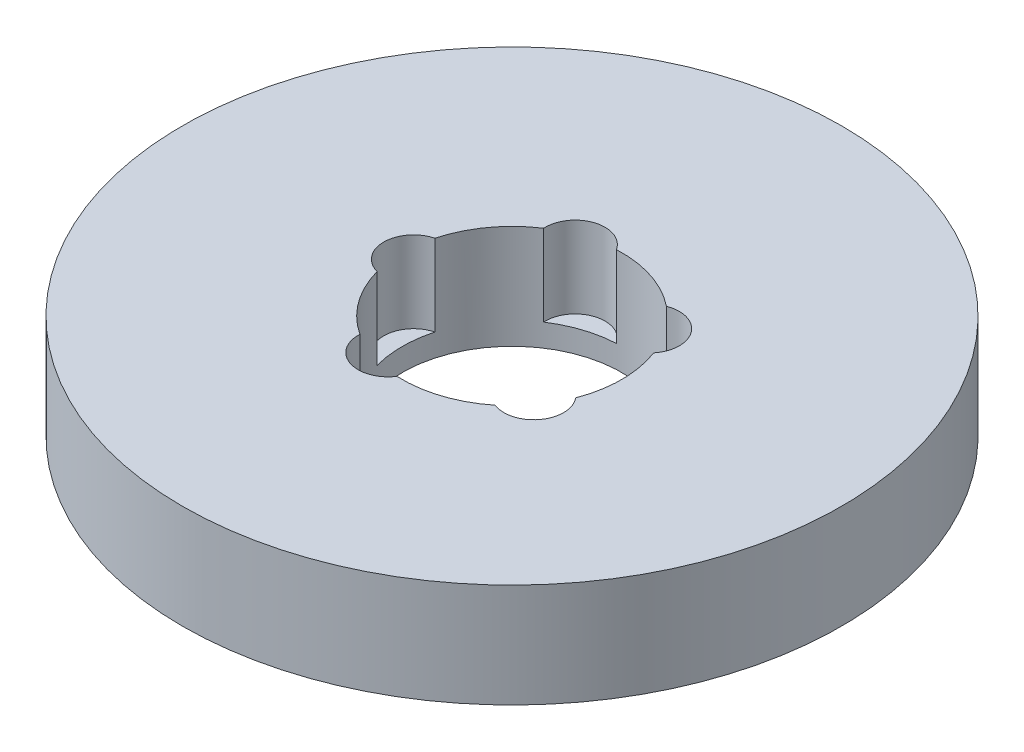
ISO-10303-21;
HEADER;
FILE_DESCRIPTION(('STEP AP214'),'2;1');
FILE_NAME('part.step','',(''),(''),'','','');
FILE_SCHEMA(('AUTOMOTIVE_DESIGN { 1 0 10303 214 1 1 1 1 }'));
ENDSEC;
DATA;
#1=APPLICATION_CONTEXT('core data for automotive mechanical design processes');
#2=APPLICATION_PROTOCOL_DEFINITION('international standard','automotive_design',2000,#1);
#3=PRODUCT_CONTEXT('',#1,'mechanical');
#4=PRODUCT('Part','Part','',(#3));
#5=PRODUCT_RELATED_PRODUCT_CATEGORY('part','',(#4));
#6=PRODUCT_DEFINITION_FORMATION('','',#4);
#7=PRODUCT_DEFINITION_CONTEXT('part definition',#1,'design');
#8=PRODUCT_DEFINITION('design','',#6,#7);
#9=PRODUCT_DEFINITION_SHAPE('','',#8);
#10=(LENGTH_UNIT() NAMED_UNIT(*) SI_UNIT(.MILLI.,.METRE.));
#11=(NAMED_UNIT(*) PLANE_ANGLE_UNIT() SI_UNIT($,.RADIAN.));
#12=(NAMED_UNIT(*) SI_UNIT($,.STERADIAN.) SOLID_ANGLE_UNIT());
#13=UNCERTAINTY_MEASURE_WITH_UNIT(LENGTH_MEASURE(1.E-05),#10,'distance_accuracy_value','');
#14=(GEOMETRIC_REPRESENTATION_CONTEXT(3) GLOBAL_UNCERTAINTY_ASSIGNED_CONTEXT((#13)) GLOBAL_UNIT_ASSIGNED_CONTEXT((#10,
#11,#12)) REPRESENTATION_CONTEXT('',''));
#15=CARTESIAN_POINT('',(0.,0.,0.));
#16=DIRECTION('',(0.,0.,1.));
#17=DIRECTION('',(1.,0.,0.));
#18=AXIS2_PLACEMENT_3D('',#15,#16,#17);
#19=CARTESIAN_POINT('',(0.,26.,0.));
#20=DIRECTION('',(0.,-1.,0.));
#21=DIRECTION('',(0.,0.,-1.));
#22=AXIS2_PLACEMENT_3D('',#19,#20,#21);
#23=CYLINDRICAL_SURFACE('',#22,82.5);
#24=CARTESIAN_POINT('',(0.,26.,0.));
#25=DIRECTION('',(0.,1.,0.));
#26=DIRECTION('',(0.,0.,1.));
#27=AXIS2_PLACEMENT_3D('',#24,#25,#26);
#28=CIRCLE('',#27,82.5);
#29=CARTESIAN_POINT('',(0.,26.,-82.5));
#30=VERTEX_POINT('',#29);
#31=EDGE_CURVE('E151',#30,#30,#28,.T.);
#32=CARTESIAN_POINT('',(0.,0.,0.));
#33=DIRECTION('',(0.,1.,0.));
#34=DIRECTION('',(0.,0.,1.));
#35=AXIS2_PLACEMENT_3D('',#32,#33,#34);
#36=CIRCLE('',#35,82.5);
#37=CARTESIAN_POINT('',(0.,0.,-82.5));
#38=VERTEX_POINT('',#37);
#39=EDGE_CURVE('E150',#38,#38,#36,.T.);
#40=CARTESIAN_POINT('',(0.,26.,-82.5));
#41=CARTESIAN_POINT('',(0.,25.7291666666667,-82.5));
#42=CARTESIAN_POINT('',(0.,25.4583333333333,-82.5));
#43=CARTESIAN_POINT('',(0.,24.9166666666667,-82.5));
#44=CARTESIAN_POINT('',(0.,24.6458333333333,-82.5));
#45=CARTESIAN_POINT('',(0.,24.1041666666667,-82.5));
#46=CARTESIAN_POINT('',(0.,23.8333333333333,-82.5));
#47=CARTESIAN_POINT('',(0.,23.2916666666667,-82.5));
#48=CARTESIAN_POINT('',(0.,23.0208333333333,-82.5));
#49=CARTESIAN_POINT('',(0.,22.4791666666667,-82.5));
#50=CARTESIAN_POINT('',(0.,22.2083333333333,-82.5));
#51=CARTESIAN_POINT('',(0.,21.6666666666667,-82.5));
#52=CARTESIAN_POINT('',(0.,21.3958333333333,-82.5));
#53=CARTESIAN_POINT('',(0.,20.8541666666667,-82.5));
#54=CARTESIAN_POINT('',(0.,20.5833333333333,-82.5));
#55=CARTESIAN_POINT('',(0.,20.0416666666667,-82.5));
#56=CARTESIAN_POINT('',(0.,19.7708333333333,-82.5));
#57=CARTESIAN_POINT('',(0.,19.2291666666667,-82.5));
#58=CARTESIAN_POINT('',(0.,18.9583333333333,-82.5));
#59=CARTESIAN_POINT('',(0.,18.4166666666667,-82.5));
#60=CARTESIAN_POINT('',(0.,18.1458333333333,-82.5));
#61=CARTESIAN_POINT('',(0.,17.6041666666667,-82.5));
#62=CARTESIAN_POINT('',(0.,17.3333333333333,-82.5));
#63=CARTESIAN_POINT('',(0.,16.7916666666667,-82.5));
#64=CARTESIAN_POINT('',(0.,16.5208333333333,-82.5));
#65=CARTESIAN_POINT('',(0.,15.9791666666667,-82.5));
#66=CARTESIAN_POINT('',(0.,15.7083333333333,-82.5));
#67=CARTESIAN_POINT('',(0.,15.1666666666667,-82.5));
#68=CARTESIAN_POINT('',(0.,14.8958333333333,-82.5));
#69=CARTESIAN_POINT('',(0.,14.3541666666667,-82.5));
#70=CARTESIAN_POINT('',(0.,14.0833333333333,-82.5));
#71=CARTESIAN_POINT('',(0.,13.5416666666667,-82.5));
#72=CARTESIAN_POINT('',(0.,13.2708333333333,-82.5));
#73=CARTESIAN_POINT('',(0.,12.7291666666667,-82.5));
#74=CARTESIAN_POINT('',(0.,12.4583333333333,-82.5));
#75=CARTESIAN_POINT('',(0.,11.9166666666667,-82.5));
#76=CARTESIAN_POINT('',(0.,11.6458333333333,-82.5));
#77=CARTESIAN_POINT('',(0.,11.1041666666667,-82.5));
#78=CARTESIAN_POINT('',(0.,10.8333333333333,-82.5));
#79=CARTESIAN_POINT('',(0.,10.2916666666667,-82.5));
#80=CARTESIAN_POINT('',(0.,10.0208333333333,-82.5));
#81=CARTESIAN_POINT('',(0.,9.47916666666667,-82.5));
#82=CARTESIAN_POINT('',(0.,9.20833333333333,-82.5));
#83=CARTESIAN_POINT('',(0.,8.66666666666667,-82.5));
#84=CARTESIAN_POINT('',(0.,8.39583333333333,-82.5));
#85=CARTESIAN_POINT('',(0.,7.85416666666667,-82.5));
#86=CARTESIAN_POINT('',(0.,7.58333333333333,-82.5));
#87=CARTESIAN_POINT('',(0.,7.04166666666667,-82.5));
#88=CARTESIAN_POINT('',(0.,6.77083333333333,-82.5));
#89=CARTESIAN_POINT('',(0.,6.22916666666667,-82.5));
#90=CARTESIAN_POINT('',(0.,5.95833333333333,-82.5));
#91=CARTESIAN_POINT('',(0.,5.41666666666667,-82.5));
#92=CARTESIAN_POINT('',(0.,5.14583333333333,-82.5));
#93=CARTESIAN_POINT('',(0.,4.60416666666667,-82.5));
#94=CARTESIAN_POINT('',(0.,4.33333333333333,-82.5));
#95=CARTESIAN_POINT('',(0.,3.79166666666667,-82.5));
#96=CARTESIAN_POINT('',(0.,3.52083333333333,-82.5));
#97=CARTESIAN_POINT('',(0.,2.97916666666667,-82.5));
#98=CARTESIAN_POINT('',(0.,2.70833333333333,-82.5));
#99=CARTESIAN_POINT('',(0.,2.16666666666667,-82.5));
#100=CARTESIAN_POINT('',(0.,1.89583333333333,-82.5));
#101=CARTESIAN_POINT('',(0.,1.35416666666667,-82.5));
#102=CARTESIAN_POINT('',(0.,1.08333333333333,-82.5));
#103=CARTESIAN_POINT('',(0.,0.541666666666667,-82.5));
#104=CARTESIAN_POINT('',(0.,0.270833333333334,-82.5));
#105=CARTESIAN_POINT('',(0.,0.,-82.5));
#106=B_SPLINE_CURVE_WITH_KNOTS('',3,(#40,#41,#42,#43,#44,#45,#46,#47,#48,#49,#50,#51,#52,#53,
#54,#55,#56,#57,#58,#59,#60,#61,#62,#63,#64,#65,#66,#67,#68,#69,#70,#71,#72,#73,#74,#75,#76,#77,
#78,#79,#80,#81,#82,#83,#84,#85,#86,#87,#88,#89,#90,#91,#92,#93,#94,#95,#96,#97,#98,#99,#100,
#101,#102,#103,#104,#105),.UNSPECIFIED.,.F.,.F.,(4,2,2,2,2,2,2,2,2,2,2,2,2,2,2,2,2,2,2,2,2,2,2,
2,2,2,2,2,2,2,2,2,4),(0.,0.812500000000001,1.625,2.4375,3.25,4.0625,4.875,5.6875,6.5,7.3125,
8.125,8.9375,9.75,10.5625,11.375,12.1875,13.,13.8125,14.625,15.4375,16.25,17.0625,17.875,
18.6875,19.5,20.3125,21.125,21.9375,22.75,23.5625,24.375,25.1875,26.),.UNSPECIFIED.);
#107=EDGE_CURVE('BSEAM39',#30,#38,#106,.T.);
#108=ORIENTED_EDGE('',*,*,#31,.F.);
#109=ORIENTED_EDGE('',*,*,#39,.T.);
#110=ORIENTED_EDGE('',*,*,#107,.T.);
#111=ORIENTED_EDGE('',*,*,#107,.F.);
#112=EDGE_LOOP('',(#108,#110,#109,#111));
#113=FACE_BOUND('',#112,.T.);
#114=ADVANCED_FACE('F39',(#113),#23,.T.);
#115=CARTESIAN_POINT('',(0.,26.,0.));
#116=DIRECTION('',(0.,1.,0.));
#117=DIRECTION('',(0.,0.,1.));
#118=AXIS2_PLACEMENT_3D('',#115,#116,#117);
#119=PLANE('',#118);
#120=CARTESIAN_POINT('',(-7.612484488797,26.,-23.4288181881716));
#121=DIRECTION('',(0.,1.,0.));
#122=DIRECTION('',(-0.95105651629515,0.,0.309016994374958));
#123=AXIS2_PLACEMENT_3D('',#120,#121,#122);
#124=CIRCLE('',#123,7.47453721191515);
#125=CARTESIAN_POINT('',(-1.32339867234192,26.,-27.4681381959907));
#126=VERTEX_POINT('',#125);
#127=CARTESIAN_POINT('',(-15.0747145232776,26.,-23.0000648269018));
#128=VERTEX_POINT('',#127);
#129=EDGE_CURVE('E196',#126,#128,#124,.T.);
#130=ORIENTED_EDGE('',*,*,#129,.F.);
#131=CARTESIAN_POINT('',(0.,26.,0.));
#132=DIRECTION('',(0.,1.,0.));
#133=DIRECTION('',(0.,0.,1.));
#134=AXIS2_PLACEMENT_3D('',#131,#132,#133);
#135=CIRCLE('',#134,27.5);
#136=CARTESIAN_POINT('',(17.2160185557923,26.,-21.4443163818904));
#137=VERTEX_POINT('',#136);
#138=EDGE_CURVE('E156',#137,#126,#135,.T.);
#139=ORIENTED_EDGE('',*,*,#138,.F.);
#140=CARTESIAN_POINT('',(19.9297431305011,26.,-14.479805956532));
#141=DIRECTION('',(0.,1.,0.));
#142=DIRECTION('',(-0.58778525229248,0.,-0.809016994374942));
#143=AXIS2_PLACEMENT_3D('',#140,#141,#142);
#144=CIRCLE('',#143,7.47453721191515);
#145=CARTESIAN_POINT('',(25.7147991417059,26.,-9.74674843738781));
#146=VERTEX_POINT('',#145);
#147=EDGE_CURVE('E254',#146,#137,#144,.T.);
#148=ORIENTED_EDGE('',*,*,#147,.F.);
#149=CARTESIAN_POINT('',(25.714799141706,26.,9.74674843738744));
#150=VERTEX_POINT('',#149);
#151=EDGE_CURVE('E153',#150,#146,#135,.T.);
#152=ORIENTED_EDGE('',*,*,#151,.F.);
#153=CARTESIAN_POINT('',(19.9297431305013,26.,14.4798059565317));
#154=DIRECTION('',(0.,1.,0.));
#155=DIRECTION('',(0.587785252292469,0.,-0.809016994374951));
#156=AXIS2_PLACEMENT_3D('',#153,#154,#155);
#157=CIRCLE('',#156,7.47453721191515);
#158=CARTESIAN_POINT('',(17.2160185557926,26.,21.4443163818902));
#159=VERTEX_POINT('',#158);
#160=EDGE_CURVE('E248',#159,#150,#157,.T.);
#161=ORIENTED_EDGE('',*,*,#160,.F.);
#162=CARTESIAN_POINT('',(-1.32339867234153,26.,27.4681381959907));
#163=VERTEX_POINT('',#162);
#164=EDGE_CURVE('E140',#163,#159,#135,.T.);
#165=ORIENTED_EDGE('',*,*,#164,.F.);
#166=CARTESIAN_POINT('',(-7.61248448879667,26.,23.4288181881717));
#167=DIRECTION('',(0.,1.,0.));
#168=DIRECTION('',(0.951056516295155,0.,0.309016994374945));
#169=AXIS2_PLACEMENT_3D('',#166,#167,#168);
#170=CIRCLE('',#169,7.47453721191515);
#171=CARTESIAN_POINT('',(-15.0747145232773,26.,23.000064826902));
#172=VERTEX_POINT('',#171);
#173=EDGE_CURVE('E117',#172,#163,#170,.T.);
#174=ORIENTED_EDGE('',*,*,#173,.F.);
#175=CARTESIAN_POINT('',(-26.5327045018796,26.,7.22949457541391));
#176=VERTEX_POINT('',#175);
#177=EDGE_CURVE('E133',#176,#172,#135,.T.);
#178=ORIENTED_EDGE('',*,*,#177,.F.);
#179=CARTESIAN_POINT('',(-24.634517283409,26.,0.));
#180=DIRECTION('',(0.,1.,0.));
#181=DIRECTION('',(0.,0.,1.));
#182=AXIS2_PLACEMENT_3D('',#179,#180,#181);
#183=CIRCLE('',#182,7.47453721191515);
#184=CARTESIAN_POINT('',(-26.5327045018796,26.,-7.22949457541391));
#185=VERTEX_POINT('',#184);
#186=EDGE_CURVE('E170',#185,#176,#183,.T.);
#187=ORIENTED_EDGE('',*,*,#186,.F.);
#188=EDGE_CURVE('E149',#128,#185,#135,.T.);
#189=ORIENTED_EDGE('',*,*,#188,.F.);
#190=EDGE_LOOP('',(#130,#139,#148,#152,#161,#165,#174,#178,#187,#189));
#191=FACE_BOUND('',#190,.T.);
#192=ORIENTED_EDGE('',*,*,#31,.T.);
#193=EDGE_LOOP('',(#192));
#194=FACE_BOUND('',#193,.T.);
#195=ADVANCED_FACE('F131',(#191,#194),#119,.T.);
#196=CARTESIAN_POINT('',(0.,0.,0.));
#197=DIRECTION('',(0.,1.,0.));
#198=DIRECTION('',(0.,0.,1.));
#199=AXIS2_PLACEMENT_3D('',#196,#197,#198);
#200=PLANE('',#199);
#201=CARTESIAN_POINT('',(0.,0.,0.));
#202=DIRECTION('',(0.,1.,0.));
#203=DIRECTION('',(0.,0.,1.));
#204=AXIS2_PLACEMENT_3D('',#201,#202,#203);
#205=CIRCLE('',#204,27.5);
#206=CARTESIAN_POINT('',(0.,0.,27.5));
#207=VERTEX_POINT('',#206);
#208=EDGE_CURVE('E160',#207,#207,#205,.T.);
#209=ORIENTED_EDGE('',*,*,#208,.T.);
#210=EDGE_LOOP('',(#209));
#211=FACE_BOUND('',#210,.T.);
#212=ORIENTED_EDGE('',*,*,#39,.F.);
#213=EDGE_LOOP('',(#212));
#214=FACE_BOUND('',#213,.T.);
#215=ADVANCED_FACE('F212',(#211,#214),#200,.F.);
#216=CARTESIAN_POINT('',(0.,26.,0.));
#217=DIRECTION('',(0.,-1.,0.));
#218=DIRECTION('',(0.,0.,-1.));
#219=AXIS2_PLACEMENT_3D('',#216,#217,#218);
#220=CYLINDRICAL_SURFACE('',#219,27.5);
#221=DIRECTION('',(0.,1.,0.));
#222=VECTOR('',#221,1.);
#223=CARTESIAN_POINT('',(-1.32339867234192,15.826622380228,-27.4681381959907));
#224=LINE('',#223,#222);
#225=CARTESIAN_POINT('',(-1.32339867234192,5.6532447604561,-27.4681381959907));
#226=VERTEX_POINT('',#225);
#227=EDGE_CURVE('E11',#226,#126,#224,.T.);
#228=ORIENTED_EDGE('',*,*,#227,.F.);
#229=CARTESIAN_POINT('',(0.,5.6532447604561,0.));
#230=DIRECTION('',(0.,1.,0.));
#231=DIRECTION('',(0.,0.,1.));
#232=AXIS2_PLACEMENT_3D('',#229,#230,#231);
#233=CIRCLE('',#232,27.5);
#234=CARTESIAN_POINT('',(-15.0747145232776,5.6532447604561,-23.0000648269018));
#235=VERTEX_POINT('',#234);
#236=EDGE_CURVE('E193',#226,#235,#233,.T.);
#237=ORIENTED_EDGE('',*,*,#236,.T.);
#238=DIRECTION('',(0.,1.,0.));
#239=VECTOR('',#238,1.);
#240=CARTESIAN_POINT('',(-15.0747145232776,15.826622380228,-23.0000648269018));
#241=LINE('',#240,#239);
#242=EDGE_CURVE('E46',#128,#235,#241,.F.);
#243=ORIENTED_EDGE('',*,*,#242,.F.);
#244=ORIENTED_EDGE('',*,*,#188,.T.);
#245=DIRECTION('',(0.,1.,0.));
#246=VECTOR('',#245,1.);
#247=CARTESIAN_POINT('',(-26.5327045018796,15.826622380228,-7.22949457541391));
#248=LINE('',#247,#246);
#249=CARTESIAN_POINT('',(-26.5327045018796,5.6532447604561,-7.22949457541391));
#250=VERTEX_POINT('',#249);
#251=EDGE_CURVE('E174',#250,#185,#248,.T.);
#252=ORIENTED_EDGE('',*,*,#251,.F.);
#253=CARTESIAN_POINT('',(0.,5.6532447604561,0.));
#254=DIRECTION('',(0.,1.,0.));
#255=DIRECTION('',(0.,0.,1.));
#256=AXIS2_PLACEMENT_3D('',#253,#254,#255);
#257=CIRCLE('',#256,27.5);
#258=CARTESIAN_POINT('',(-26.5327045018796,5.6532447604561,7.22949457541391));
#259=VERTEX_POINT('',#258);
#260=EDGE_CURVE('E171',#250,#259,#257,.T.);
#261=ORIENTED_EDGE('',*,*,#260,.T.);
#262=DIRECTION('',(0.,1.,0.));
#263=VECTOR('',#262,1.);
#264=CARTESIAN_POINT('',(-26.5327045018796,15.826622380228,7.22949457541391));
#265=LINE('',#264,#263);
#266=EDGE_CURVE('E148',#176,#259,#265,.F.);
#267=ORIENTED_EDGE('',*,*,#266,.F.);
#268=ORIENTED_EDGE('',*,*,#177,.T.);
#269=DIRECTION('',(0.,1.,0.));
#270=VECTOR('',#269,1.);
#271=CARTESIAN_POINT('',(-15.0747145232773,15.826622380228,23.000064826902));
#272=LINE('',#271,#270);
#273=CARTESIAN_POINT('',(-15.0747145232773,5.6532447604561,23.000064826902));
#274=VERTEX_POINT('',#273);
#275=EDGE_CURVE('E111',#274,#172,#272,.T.);
#276=ORIENTED_EDGE('',*,*,#275,.F.);
#277=CARTESIAN_POINT('',(0.,5.6532447604561,0.));
#278=DIRECTION('',(0.,1.,0.));
#279=DIRECTION('',(0.,0.,1.));
#280=AXIS2_PLACEMENT_3D('',#277,#278,#279);
#281=CIRCLE('',#280,27.5);
#282=CARTESIAN_POINT('',(-1.32339867234153,5.6532447604561,27.4681381959907));
#283=VERTEX_POINT('',#282);
#284=EDGE_CURVE('E180',#274,#283,#281,.T.);
#285=ORIENTED_EDGE('',*,*,#284,.T.);
#286=DIRECTION('',(0.,1.,0.));
#287=VECTOR('',#286,1.);
#288=CARTESIAN_POINT('',(-1.32339867234153,15.826622380228,27.4681381959907));
#289=LINE('',#288,#287);
#290=EDGE_CURVE('E124',#163,#283,#289,.F.);
#291=ORIENTED_EDGE('',*,*,#290,.F.);
#292=ORIENTED_EDGE('',*,*,#164,.T.);
#293=DIRECTION('',(0.,1.,0.));
#294=VECTOR('',#293,1.);
#295=CARTESIAN_POINT('',(17.2160185557927,15.826622380228,21.4443163818902));
#296=LINE('',#295,#294);
#297=CARTESIAN_POINT('',(17.2160185557926,5.6532447604561,21.4443163818902));
#298=VERTEX_POINT('',#297);
#299=EDGE_CURVE('E183',#298,#159,#296,.T.);
#300=ORIENTED_EDGE('',*,*,#299,.F.);
#301=CARTESIAN_POINT('',(0.,5.6532447604561,0.));
#302=DIRECTION('',(0.,1.,0.));
#303=DIRECTION('',(0.,0.,1.));
#304=AXIS2_PLACEMENT_3D('',#301,#302,#303);
#305=CIRCLE('',#304,27.5);
#306=CARTESIAN_POINT('',(25.714799141706,5.6532447604561,9.74674843738744));
#307=VERTEX_POINT('',#306);
#308=EDGE_CURVE('E123',#298,#307,#305,.T.);
#309=ORIENTED_EDGE('',*,*,#308,.T.);
#310=DIRECTION('',(0.,1.,0.));
#311=VECTOR('',#310,1.);
#312=CARTESIAN_POINT('',(25.714799141706,15.826622380228,9.74674843738744));
#313=LINE('',#312,#311);
#314=EDGE_CURVE('E185',#150,#307,#313,.F.);
#315=ORIENTED_EDGE('',*,*,#314,.F.);
#316=ORIENTED_EDGE('',*,*,#151,.T.);
#317=DIRECTION('',(0.,1.,0.));
#318=VECTOR('',#317,1.);
#319=CARTESIAN_POINT('',(25.7147991417059,15.826622380228,-9.74674843738781));
#320=LINE('',#319,#318);
#321=CARTESIAN_POINT('',(25.7147991417059,5.6532447604561,-9.74674843738781));
#322=VERTEX_POINT('',#321);
#323=EDGE_CURVE('E195',#322,#146,#320,.T.);
#324=ORIENTED_EDGE('',*,*,#323,.F.);
#325=CARTESIAN_POINT('',(0.,5.6532447604561,0.));
#326=DIRECTION('',(0.,1.,0.));
#327=DIRECTION('',(0.,0.,1.));
#328=AXIS2_PLACEMENT_3D('',#325,#326,#327);
#329=CIRCLE('',#328,27.5);
#330=CARTESIAN_POINT('',(17.2160185557923,5.6532447604561,-21.4443163818904));
#331=VERTEX_POINT('',#330);
#332=EDGE_CURVE('E190',#322,#331,#329,.T.);
#333=ORIENTED_EDGE('',*,*,#332,.T.);
#334=DIRECTION('',(0.,1.,0.));
#335=VECTOR('',#334,1.);
#336=CARTESIAN_POINT('',(17.2160185557923,15.826622380228,-21.4443163818904));
#337=LINE('',#336,#335);
#338=EDGE_CURVE('E189',#137,#331,#337,.F.);
#339=ORIENTED_EDGE('',*,*,#338,.F.);
#340=ORIENTED_EDGE('',*,*,#138,.T.);
#341=EDGE_LOOP('',(#228,#237,#243,#244,#252,#261,#267,#268,#276,#285,#291,#292,#300,#309,#315,
#316,#324,#333,#339,#340));
#342=FACE_BOUND('',#341,.T.);
#343=ORIENTED_EDGE('',*,*,#208,.F.);
#344=EDGE_LOOP('',(#343));
#345=FACE_BOUND('',#344,.T.);
#346=ADVANCED_FACE('F142',(#342,#345),#220,.F.);
#347=CARTESIAN_POINT('',(-24.634517283409,5.6532447604561,0.));
#348=DIRECTION('',(0.,1.,0.));
#349=DIRECTION('',(0.,0.,1.));
#350=AXIS2_PLACEMENT_3D('',#347,#348,#349);
#351=CYLINDRICAL_SURFACE('',#350,7.47453721191515);
#352=ORIENTED_EDGE('',*,*,#251,.T.);
#353=ORIENTED_EDGE('',*,*,#186,.T.);
#354=ORIENTED_EDGE('',*,*,#266,.T.);
#355=CARTESIAN_POINT('',(-24.634517283409,5.6532447604561,0.));
#356=DIRECTION('',(0.,1.,0.));
#357=DIRECTION('',(0.,0.,1.));
#358=AXIS2_PLACEMENT_3D('',#355,#356,#357);
#359=CIRCLE('',#358,7.47453721191515);
#360=EDGE_CURVE('E163',#250,#259,#359,.T.);
#361=ORIENTED_EDGE('',*,*,#360,.F.);
#362=EDGE_LOOP('',(#352,#353,#354,#361));
#363=FACE_BOUND('',#362,.T.);
#364=ADVANCED_FACE('F221',(#363),#351,.F.);
#365=CARTESIAN_POINT('',(-24.634517283409,5.6532447604561,0.));
#366=DIRECTION('',(0.,1.,0.));
#367=DIRECTION('',(0.,0.,1.));
#368=AXIS2_PLACEMENT_3D('',#365,#366,#367);
#369=PLANE('',#368);
#370=ORIENTED_EDGE('',*,*,#360,.T.);
#371=ORIENTED_EDGE('',*,*,#260,.F.);
#372=EDGE_LOOP('',(#370,#371));
#373=FACE_BOUND('',#372,.T.);
#374=ADVANCED_FACE('F227',(#373),#369,.T.);
#375=CARTESIAN_POINT('',(-7.61248448879667,5.6532447604561,23.4288181881717));
#376=DIRECTION('',(0.,1.,0.));
#377=DIRECTION('',(0.,0.,1.));
#378=AXIS2_PLACEMENT_3D('',#375,#376,#377);
#379=CYLINDRICAL_SURFACE('',#378,7.47453721191515);
#380=ORIENTED_EDGE('',*,*,#275,.T.);
#381=ORIENTED_EDGE('',*,*,#173,.T.);
#382=ORIENTED_EDGE('',*,*,#290,.T.);
#383=CARTESIAN_POINT('',(-7.61248448879667,5.6532447604561,23.4288181881717));
#384=DIRECTION('',(0.,1.,0.));
#385=DIRECTION('',(0.951056516295155,0.,0.309016994374945));
#386=AXIS2_PLACEMENT_3D('',#383,#384,#385);
#387=CIRCLE('',#386,7.47453721191515);
#388=EDGE_CURVE('E119',#274,#283,#387,.T.);
#389=ORIENTED_EDGE('',*,*,#388,.F.);
#390=EDGE_LOOP('',(#380,#381,#382,#389));
#391=FACE_BOUND('',#390,.T.);
#392=ADVANCED_FACE('F116',(#391),#379,.F.);
#393=CARTESIAN_POINT('',(-7.61248448879667,5.6532447604561,23.4288181881717));
#394=DIRECTION('',(0.,1.,0.));
#395=DIRECTION('',(0.951056516295155,0.,0.309016994374945));
#396=AXIS2_PLACEMENT_3D('',#393,#394,#395);
#397=PLANE('',#396);
#398=ORIENTED_EDGE('',*,*,#388,.T.);
#399=ORIENTED_EDGE('',*,*,#284,.F.);
#400=EDGE_LOOP('',(#398,#399));
#401=FACE_BOUND('',#400,.T.);
#402=ADVANCED_FACE('F234',(#401),#397,.T.);
#403=CARTESIAN_POINT('',(19.9297431305013,5.6532447604561,14.4798059565317));
#404=DIRECTION('',(0.,1.,0.));
#405=DIRECTION('',(0.,0.,1.));
#406=AXIS2_PLACEMENT_3D('',#403,#404,#405);
#407=CYLINDRICAL_SURFACE('',#406,7.47453721191515);
#408=ORIENTED_EDGE('',*,*,#299,.T.);
#409=ORIENTED_EDGE('',*,*,#160,.T.);
#410=ORIENTED_EDGE('',*,*,#314,.T.);
#411=CARTESIAN_POINT('',(19.9297431305013,5.6532447604561,14.4798059565317));
#412=DIRECTION('',(0.,1.,0.));
#413=DIRECTION('',(0.587785252292469,0.,-0.809016994374951));
#414=AXIS2_PLACEMENT_3D('',#411,#412,#413);
#415=CIRCLE('',#414,7.47453721191515);
#416=EDGE_CURVE('E137',#298,#307,#415,.T.);
#417=ORIENTED_EDGE('',*,*,#416,.F.);
#418=EDGE_LOOP('',(#408,#409,#410,#417));
#419=FACE_BOUND('',#418,.T.);
#420=ADVANCED_FACE('F240',(#419),#407,.F.);
#421=CARTESIAN_POINT('',(19.9297431305013,5.6532447604561,14.4798059565317));
#422=DIRECTION('',(0.,1.,0.));
#423=DIRECTION('',(0.587785252292469,0.,-0.809016994374951));
#424=AXIS2_PLACEMENT_3D('',#421,#422,#423);
#425=PLANE('',#424);
#426=ORIENTED_EDGE('',*,*,#416,.T.);
#427=ORIENTED_EDGE('',*,*,#308,.F.);
#428=EDGE_LOOP('',(#426,#427));
#429=FACE_BOUND('',#428,.T.);
#430=ADVANCED_FACE('F245',(#429),#425,.T.);
#431=CARTESIAN_POINT('',(19.9297431305011,5.6532447604561,-14.479805956532));
#432=DIRECTION('',(0.,1.,0.));
#433=DIRECTION('',(0.,0.,1.));
#434=AXIS2_PLACEMENT_3D('',#431,#432,#433);
#435=CYLINDRICAL_SURFACE('',#434,7.47453721191515);
#436=ORIENTED_EDGE('',*,*,#323,.T.);
#437=ORIENTED_EDGE('',*,*,#147,.T.);
#438=ORIENTED_EDGE('',*,*,#338,.T.);
#439=CARTESIAN_POINT('',(19.9297431305011,5.6532447604561,-14.479805956532));
#440=DIRECTION('',(0.,1.,0.));
#441=DIRECTION('',(-0.58778525229248,0.,-0.809016994374942));
#442=AXIS2_PLACEMENT_3D('',#439,#440,#441);
#443=CIRCLE('',#442,7.47453721191515);
#444=EDGE_CURVE('E56',#322,#331,#443,.T.);
#445=ORIENTED_EDGE('',*,*,#444,.F.);
#446=EDGE_LOOP('',(#436,#437,#438,#445));
#447=FACE_BOUND('',#446,.T.);
#448=ADVANCED_FACE('F264',(#447),#435,.F.);
#449=CARTESIAN_POINT('',(19.9297431305011,5.6532447604561,-14.479805956532));
#450=DIRECTION('',(0.,1.,0.));
#451=DIRECTION('',(-0.58778525229248,0.,-0.809016994374942));
#452=AXIS2_PLACEMENT_3D('',#449,#450,#451);
#453=PLANE('',#452);
#454=ORIENTED_EDGE('',*,*,#444,.T.);
#455=ORIENTED_EDGE('',*,*,#332,.F.);
#456=EDGE_LOOP('',(#454,#455));
#457=FACE_BOUND('',#456,.T.);
#458=ADVANCED_FACE('F202',(#457),#453,.T.);
#459=CARTESIAN_POINT('',(-7.612484488797,5.6532447604561,-23.4288181881716));
#460=DIRECTION('',(0.,1.,0.));
#461=DIRECTION('',(0.,0.,1.));
#462=AXIS2_PLACEMENT_3D('',#459,#460,#461);
#463=CYLINDRICAL_SURFACE('',#462,7.47453721191515);
#464=ORIENTED_EDGE('',*,*,#227,.T.);
#465=ORIENTED_EDGE('',*,*,#129,.T.);
#466=ORIENTED_EDGE('',*,*,#242,.T.);
#467=CARTESIAN_POINT('',(-7.612484488797,5.6532447604561,-23.4288181881716));
#468=DIRECTION('',(0.,1.,0.));
#469=DIRECTION('',(-0.95105651629515,0.,0.309016994374958));
#470=AXIS2_PLACEMENT_3D('',#467,#468,#469);
#471=CIRCLE('',#470,7.47453721191515);
#472=EDGE_CURVE('E55',#226,#235,#471,.T.);
#473=ORIENTED_EDGE('',*,*,#472,.F.);
#474=EDGE_LOOP('',(#464,#465,#466,#473));
#475=FACE_BOUND('',#474,.T.);
#476=ADVANCED_FACE('F197',(#475),#463,.F.);
#477=CARTESIAN_POINT('',(-7.612484488797,5.6532447604561,-23.4288181881716));
#478=DIRECTION('',(0.,1.,0.));
#479=DIRECTION('',(-0.95105651629515,0.,0.309016994374958));
#480=AXIS2_PLACEMENT_3D('',#477,#478,#479);
#481=PLANE('',#480);
#482=ORIENTED_EDGE('',*,*,#472,.T.);
#483=ORIENTED_EDGE('',*,*,#236,.F.);
#484=EDGE_LOOP('',(#482,#483));
#485=FACE_BOUND('',#484,.T.);
#486=ADVANCED_FACE('F200',(#485),#481,.T.);
#487=CLOSED_SHELL('',(#114,#195,#215,#346,#364,#374,#392,#402,#420,#430,#448,#458,#476,#486));
#488=MANIFOLD_SOLID_BREP('B2',#487);
#489=ADVANCED_BREP_SHAPE_REPRESENTATION('',(#18,#488),#14);
#490=SHAPE_DEFINITION_REPRESENTATION(#9,#489);
ENDSEC;
END-ISO-10303-21;
